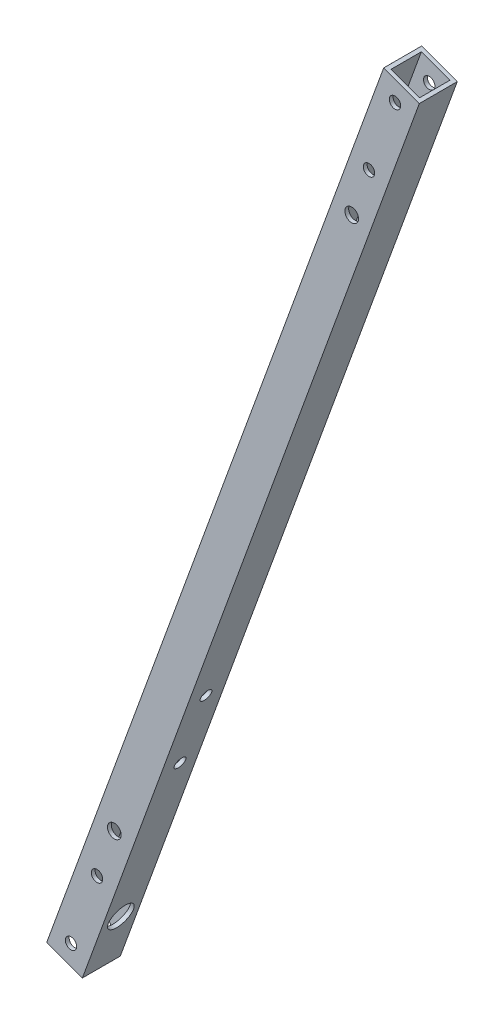
ISO-10303-21;
HEADER;
FILE_DESCRIPTION(('STEP AP214'),'2;1');
FILE_NAME('part.step','',(''),(''),'','','');
FILE_SCHEMA(('AUTOMOTIVE_DESIGN { 1 0 10303 214 1 1 1 1 }'));
ENDSEC;
DATA;
#1=APPLICATION_CONTEXT('core data for automotive mechanical design processes');
#2=APPLICATION_PROTOCOL_DEFINITION('international standard','automotive_design',2000,#1);
#3=PRODUCT_CONTEXT('',#1,'mechanical');
#4=PRODUCT('Part','Part','',(#3));
#5=PRODUCT_RELATED_PRODUCT_CATEGORY('part','',(#4));
#6=PRODUCT_DEFINITION_FORMATION('','',#4);
#7=PRODUCT_DEFINITION_CONTEXT('part definition',#1,'design');
#8=PRODUCT_DEFINITION('design','',#6,#7);
#9=PRODUCT_DEFINITION_SHAPE('','',#8);
#10=(LENGTH_UNIT() NAMED_UNIT(*) SI_UNIT(.MILLI.,.METRE.));
#11=(NAMED_UNIT(*) PLANE_ANGLE_UNIT() SI_UNIT($,.RADIAN.));
#12=(NAMED_UNIT(*) SI_UNIT($,.STERADIAN.) SOLID_ANGLE_UNIT());
#13=UNCERTAINTY_MEASURE_WITH_UNIT(LENGTH_MEASURE(1.E-05),#10,'distance_accuracy_value','');
#14=(GEOMETRIC_REPRESENTATION_CONTEXT(3) GLOBAL_UNCERTAINTY_ASSIGNED_CONTEXT((#13)) GLOBAL_UNIT_ASSIGNED_CONTEXT((#10,
#11,#12)) REPRESENTATION_CONTEXT('',''));
#15=CARTESIAN_POINT('',(0.,0.,0.));
#16=DIRECTION('',(0.,0.,1.));
#17=DIRECTION('',(1.,0.,0.));
#18=AXIS2_PLACEMENT_3D('',#15,#16,#17);
#19=CARTESIAN_POINT('',(-14.0953893117886,5.13030214988498,-15.));
#20=DIRECTION('',(0.342020143325665,0.93969262078591,0.));
#21=DIRECTION('',(-0.93969262078591,0.342020143325665,0.));
#22=AXIS2_PLACEMENT_3D('',#19,#20,#21);
#23=PLANE('',#22);
#24=DIRECTION('',(0.93969262078591,-0.342020143325665,0.));
#25=VECTOR('',#24,1.);
#26=CARTESIAN_POINT('',(-14.0953893117886,5.13030214988498,0.));
#27=LINE('',#26,#25);
#28=CARTESIAN_POINT('',(-14.0953893117886,5.13030214988498,0.));
#29=VERTEX_POINT('',#28);
#30=CARTESIAN_POINT('',(0.,0.,0.));
#31=VERTEX_POINT('',#30);
#32=EDGE_CURVE('E148',#29,#31,#27,.T.);
#33=ORIENTED_EDGE('',*,*,#32,.F.);
#34=DIRECTION('',(0.,0.,1.));
#35=VECTOR('',#34,1.);
#36=CARTESIAN_POINT('',(-14.0953893117886,5.13030214988498,-15.));
#37=LINE('',#36,#35);
#38=CARTESIAN_POINT('',(-14.0953893117886,5.13030214988498,-15.));
#39=VERTEX_POINT('',#38);
#40=EDGE_CURVE('E172',#39,#29,#37,.T.);
#41=ORIENTED_EDGE('',*,*,#40,.F.);
#42=DIRECTION('',(0.93969262078591,-0.342020143325665,0.));
#43=VECTOR('',#42,1.);
#44=CARTESIAN_POINT('',(-14.0953893117886,5.13030214988498,-15.));
#45=LINE('',#44,#43);
#46=CARTESIAN_POINT('',(0.,0.,-15.));
#47=VERTEX_POINT('',#46);
#48=EDGE_CURVE('E157',#39,#47,#45,.T.);
#49=ORIENTED_EDGE('',*,*,#48,.T.);
#50=DIRECTION('',(0.,0.,1.));
#51=VECTOR('',#50,1.);
#52=CARTESIAN_POINT('',(0.,0.,-15.));
#53=LINE('',#52,#51);
#54=EDGE_CURVE('E11',#47,#31,#53,.T.);
#55=ORIENTED_EDGE('',*,*,#54,.T.);
#56=EDGE_LOOP('',(#33,#41,#49,#55));
#57=FACE_BOUND('',#56,.T.);
#58=DIRECTION('',(0.93969262078591,-0.342020143325665,0.));
#59=VECTOR('',#58,1.);
#60=CARTESIAN_POINT('',(0.,0.,-1.5));
#61=LINE('',#60,#59);
#62=CARTESIAN_POINT('',(-12.6858503806098,4.61727193489649,-1.5));
#63=VERTEX_POINT('',#62);
#64=CARTESIAN_POINT('',(-1.40953893117884,0.513030214988488,-1.5));
#65=VERTEX_POINT('',#64);
#66=EDGE_CURVE('E121',#63,#65,#61,.T.);
#67=ORIENTED_EDGE('',*,*,#66,.T.);
#68=DIRECTION('',(0.,0.,1.));
#69=VECTOR('',#68,1.);
#70=CARTESIAN_POINT('',(-1.40953893117884,0.513030214988552,-15.));
#71=LINE('',#70,#69);
#72=CARTESIAN_POINT('',(-1.40953893117884,0.513030214988488,-13.5));
#73=VERTEX_POINT('',#72);
#74=EDGE_CURVE('E114',#73,#65,#71,.T.);
#75=ORIENTED_EDGE('',*,*,#74,.F.);
#76=DIRECTION('',(0.93969262078591,-0.342020143325665,0.));
#77=VECTOR('',#76,1.);
#78=CARTESIAN_POINT('',(0.,0.,-13.5));
#79=LINE('',#78,#77);
#80=CARTESIAN_POINT('',(-12.6858503806098,4.61727193489649,-13.5));
#81=VERTEX_POINT('',#80);
#82=EDGE_CURVE('E138',#81,#73,#79,.T.);
#83=ORIENTED_EDGE('',*,*,#82,.F.);
#84=DIRECTION('',(0.,0.,1.));
#85=VECTOR('',#84,1.);
#86=CARTESIAN_POINT('',(-12.6858503806098,4.61727193489649,-15.));
#87=LINE('',#86,#85);
#88=EDGE_CURVE('E143',#81,#63,#87,.T.);
#89=ORIENTED_EDGE('',*,*,#88,.T.);
#90=EDGE_LOOP('',(#67,#75,#83,#89));
#91=FACE_BOUND('',#90,.T.);
#92=ADVANCED_FACE('F43',(#57,#91),#23,.F.);
#93=CARTESIAN_POINT('',(133.115214400364,365.731045750865,-15.));
#94=DIRECTION('',(-0.342020143325665,-0.93969262078591,0.));
#95=DIRECTION('',(0.93969262078591,-0.342020143325665,0.));
#96=AXIS2_PLACEMENT_3D('',#93,#94,#95);
#97=PLANE('',#96);
#98=DIRECTION('',(-0.93969262078591,0.342020143325665,0.));
#99=VECTOR('',#98,1.);
#100=CARTESIAN_POINT('',(133.115214400364,365.731045750865,0.));
#101=LINE('',#100,#99);
#102=CARTESIAN_POINT('',(133.115214400364,365.731045750865,0.));
#103=VERTEX_POINT('',#102);
#104=CARTESIAN_POINT('',(119.019825088576,370.86134790075,0.));
#105=VERTEX_POINT('',#104);
#106=EDGE_CURVE('E179',#103,#105,#101,.T.);
#107=ORIENTED_EDGE('',*,*,#106,.F.);
#108=DIRECTION('',(0.,0.,1.));
#109=VECTOR('',#108,1.);
#110=CARTESIAN_POINT('',(133.115214400364,365.731045750865,-15.));
#111=LINE('',#110,#109);
#112=CARTESIAN_POINT('',(133.115214400364,365.731045750865,-15.));
#113=VERTEX_POINT('',#112);
#114=EDGE_CURVE('E52',#113,#103,#111,.T.);
#115=ORIENTED_EDGE('',*,*,#114,.F.);
#116=DIRECTION('',(-0.93969262078591,0.342020143325665,0.));
#117=VECTOR('',#116,1.);
#118=CARTESIAN_POINT('',(133.115214400364,365.731045750865,-15.));
#119=LINE('',#118,#117);
#120=CARTESIAN_POINT('',(119.019825088576,370.86134790075,-15.));
#121=VERTEX_POINT('',#120);
#122=EDGE_CURVE('E165',#113,#121,#119,.T.);
#123=ORIENTED_EDGE('',*,*,#122,.T.);
#124=DIRECTION('',(0.,0.,1.));
#125=VECTOR('',#124,1.);
#126=CARTESIAN_POINT('',(119.019825088576,370.86134790075,-15.));
#127=LINE('',#126,#125);
#128=EDGE_CURVE('E188',#121,#105,#127,.T.);
#129=ORIENTED_EDGE('',*,*,#128,.T.);
#130=EDGE_LOOP('',(#107,#115,#123,#129));
#131=FACE_BOUND('',#130,.T.);
#132=DIRECTION('',(-0.93969262078591,0.342020143325665,0.));
#133=VECTOR('',#132,1.);
#134=CARTESIAN_POINT('',(133.115214400364,365.731045750865,-1.5));
#135=LINE('',#134,#133);
#136=CARTESIAN_POINT('',(131.705675469185,366.244075965854,-1.5));
#137=VERTEX_POINT('',#136);
#138=CARTESIAN_POINT('',(120.429364019754,370.348317685762,-1.5));
#139=VERTEX_POINT('',#138);
#140=EDGE_CURVE('E120',#137,#139,#135,.T.);
#141=ORIENTED_EDGE('',*,*,#140,.T.);
#142=DIRECTION('',(0.,0.,1.));
#143=VECTOR('',#142,1.);
#144=CARTESIAN_POINT('',(120.429364019754,370.348317685762,-15.));
#145=LINE('',#144,#143);
#146=CARTESIAN_POINT('',(120.429364019754,370.348317685762,-13.5));
#147=VERTEX_POINT('',#146);
#148=EDGE_CURVE('E129',#147,#139,#145,.T.);
#149=ORIENTED_EDGE('',*,*,#148,.F.);
#150=DIRECTION('',(-0.93969262078591,0.342020143325665,0.));
#151=VECTOR('',#150,1.);
#152=CARTESIAN_POINT('',(133.115214400364,365.731045750865,-13.5));
#153=LINE('',#152,#151);
#154=CARTESIAN_POINT('',(131.705675469185,366.244075965854,-13.5));
#155=VERTEX_POINT('',#154);
#156=EDGE_CURVE('E127',#155,#147,#153,.T.);
#157=ORIENTED_EDGE('',*,*,#156,.F.);
#158=DIRECTION('',(0.,0.,1.));
#159=VECTOR('',#158,1.);
#160=CARTESIAN_POINT('',(131.705675469185,366.244075965854,-15.));
#161=LINE('',#160,#159);
#162=EDGE_CURVE('E111',#155,#137,#161,.T.);
#163=ORIENTED_EDGE('',*,*,#162,.T.);
#164=EDGE_LOOP('',(#141,#149,#157,#163));
#165=FACE_BOUND('',#164,.T.);
#166=ADVANCED_FACE('F125',(#131,#165),#97,.F.);
#167=CARTESIAN_POINT('',(133.115214400364,365.731045750865,-15.));
#168=DIRECTION('',(-0.93969262078591,0.342020143325665,0.));
#169=DIRECTION('',(-0.342020143325665,-0.93969262078591,0.));
#170=AXIS2_PLACEMENT_3D('',#167,#168,#169);
#171=PLANE('',#170);
#172=CARTESIAN_POINT('',(7.69545322482748,21.143083967683,-7.5));
#173=DIRECTION('',(-0.93969262078591,0.342020143325666,0.));
#174=DIRECTION('',(0.342020143325666,0.93969262078591,0.));
#175=AXIS2_PLACEMENT_3D('',#172,#173,#174);
#176=CIRCLE('',#175,4.99999999999999);
#177=CARTESIAN_POINT('',(9.4055539414558,25.8415470716125,-7.5));
#178=VERTEX_POINT('',#177);
#179=EDGE_CURVE('E332',#178,#178,#176,.T.);
#180=ORIENTED_EDGE('',*,*,#179,.T.);
#181=EDGE_LOOP('',(#180));
#182=FACE_BOUND('',#181,.T.);
#183=CARTESIAN_POINT('',(41.3426140285346,113.587898504628,-7.5));
#184=DIRECTION('',(0.93969262078591,-0.342020143325665,0.));
#185=DIRECTION('',(-0.342020143325665,-0.93969262078591,0.));
#186=AXIS2_PLACEMENT_3D('',#183,#184,#185);
#187=CIRCLE('',#186,2.25);
#188=CARTESIAN_POINT('',(40.5730687060519,111.47359010786,-7.5));
#189=VERTEX_POINT('',#188);
#190=EDGE_CURVE('E258',#189,#189,#187,.T.);
#191=ORIENTED_EDGE('',*,*,#190,.F.);
#192=EDGE_LOOP('',(#191));
#193=FACE_BOUND('',#192,.T.);
#194=CARTESIAN_POINT('',(31.0820097287646,85.3971198810506,-7.5));
#195=DIRECTION('',(0.93969262078591,-0.342020143325665,0.));
#196=DIRECTION('',(-0.342020143325665,-0.93969262078591,0.));
#197=AXIS2_PLACEMENT_3D('',#194,#195,#196);
#198=CIRCLE('',#197,2.25);
#199=CARTESIAN_POINT('',(30.3124644062819,83.2828114842823,-7.5));
#200=VERTEX_POINT('',#199);
#201=EDGE_CURVE('E242',#200,#200,#198,.T.);
#202=ORIENTED_EDGE('',*,*,#201,.F.);
#203=EDGE_LOOP('',(#202));
#204=FACE_BOUND('',#203,.T.);
#205=DIRECTION('',(0.342020143325665,0.93969262078591,0.));
#206=VECTOR('',#205,1.);
#207=CARTESIAN_POINT('',(133.115214400364,365.731045750865,0.));
#208=LINE('',#207,#206);
#209=EDGE_CURVE('E176',#31,#103,#208,.T.);
#210=ORIENTED_EDGE('',*,*,#209,.F.);
#211=ORIENTED_EDGE('',*,*,#54,.F.);
#212=DIRECTION('',(0.342020143325665,0.93969262078591,0.));
#213=VECTOR('',#212,1.);
#214=CARTESIAN_POINT('',(133.115214400364,365.731045750865,-15.));
#215=LINE('',#214,#213);
#216=EDGE_CURVE('E161',#47,#113,#215,.T.);
#217=ORIENTED_EDGE('',*,*,#216,.T.);
#218=ORIENTED_EDGE('',*,*,#114,.T.);
#219=EDGE_LOOP('',(#210,#211,#217,#218));
#220=FACE_BOUND('',#219,.T.);
#221=ADVANCED_FACE('F373',(#182,#193,#204,#220),#171,.F.);
#222=CARTESIAN_POINT('',(119.019825088576,370.86134790075,-15.));
#223=DIRECTION('',(0.93969262078591,-0.342020143325666,0.));
#224=DIRECTION('',(0.342020143325666,0.93969262078591,0.));
#225=AXIS2_PLACEMENT_3D('',#222,#223,#224);
#226=PLANE('',#225);
#227=CARTESIAN_POINT('',(27.2472247167459,118.718200654513,-7.5));
#228=DIRECTION('',(0.93969262078591,-0.342020143325665,0.));
#229=DIRECTION('',(-0.342020143325665,-0.93969262078591,0.));
#230=AXIS2_PLACEMENT_3D('',#227,#228,#229);
#231=CIRCLE('',#230,2.25);
#232=CARTESIAN_POINT('',(26.4776793942632,116.603892257745,-7.5));
#233=VERTEX_POINT('',#232);
#234=EDGE_CURVE('E233',#233,#233,#231,.T.);
#235=ORIENTED_EDGE('',*,*,#234,.T.);
#236=EDGE_LOOP('',(#235));
#237=FACE_BOUND('',#236,.T.);
#238=CARTESIAN_POINT('',(16.986620416976,90.5274220309356,-7.5));
#239=DIRECTION('',(0.93969262078591,-0.342020143325665,0.));
#240=DIRECTION('',(-0.342020143325665,-0.93969262078591,0.));
#241=AXIS2_PLACEMENT_3D('',#238,#239,#240);
#242=CIRCLE('',#241,2.25);
#243=CARTESIAN_POINT('',(16.2170750944932,88.4131136341673,-7.5));
#244=VERTEX_POINT('',#243);
#245=EDGE_CURVE('E346',#244,#244,#242,.T.);
#246=ORIENTED_EDGE('',*,*,#245,.T.);
#247=EDGE_LOOP('',(#246));
#248=FACE_BOUND('',#247,.T.);
#249=CARTESIAN_POINT('',(-6.39993608696117,26.273386117568,-7.5));
#250=DIRECTION('',(0.93969262078591,-0.342020143325665,0.));
#251=DIRECTION('',(-0.342020143325665,-0.93969262078591,0.));
#252=AXIS2_PLACEMENT_3D('',#249,#250,#251);
#253=CIRCLE('',#252,2.7);
#254=CARTESIAN_POINT('',(-7.32339047394047,23.736216041446,-7.5));
#255=VERTEX_POINT('',#254);
#256=EDGE_CURVE('E251',#255,#255,#253,.T.);
#257=ORIENTED_EDGE('',*,*,#256,.T.);
#258=EDGE_LOOP('',(#257));
#259=FACE_BOUND('',#258,.T.);
#260=DIRECTION('',(-0.342020143325666,-0.93969262078591,0.));
#261=VECTOR('',#260,1.);
#262=CARTESIAN_POINT('',(119.019825088576,370.86134790075,0.));
#263=LINE('',#262,#261);
#264=EDGE_CURVE('E162',#105,#29,#263,.T.);
#265=ORIENTED_EDGE('',*,*,#264,.F.);
#266=ORIENTED_EDGE('',*,*,#128,.F.);
#267=DIRECTION('',(-0.342020143325666,-0.93969262078591,0.));
#268=VECTOR('',#267,1.);
#269=CARTESIAN_POINT('',(119.019825088576,370.86134790075,-15.));
#270=LINE('',#269,#268);
#271=EDGE_CURVE('E169',#121,#39,#270,.T.);
#272=ORIENTED_EDGE('',*,*,#271,.T.);
#273=ORIENTED_EDGE('',*,*,#40,.T.);
#274=EDGE_LOOP('',(#265,#266,#272,#273));
#275=FACE_BOUND('',#274,.T.);
#276=ADVANCED_FACE('F369',(#237,#248,#259,#275),#226,.F.);
#277=CARTESIAN_POINT('',(0.,0.,-15.));
#278=DIRECTION('',(0.,0.,1.));
#279=DIRECTION('',(-1.,0.,0.));
#280=AXIS2_PLACEMENT_3D('',#277,#278,#279);
#281=PLANE('',#280);
#282=CARTESIAN_POINT('',(106.401361503244,314.263871130618,-15.));
#283=DIRECTION('',(0.,0.,1.));
#284=DIRECTION('',(1.,0.,0.));
#285=AXIS2_PLACEMENT_3D('',#282,#283,#284);
#286=CIRCLE('',#285,4.99999999999999);
#287=CARTESIAN_POINT('',(111.401361503244,314.263871130618,-15.));
#288=VERTEX_POINT('',#287);
#289=EDGE_CURVE('E313',#288,#288,#286,.T.);
#290=ORIENTED_EDGE('',*,*,#289,.T.);
#291=EDGE_LOOP('',(#290));
#292=FACE_BOUND('',#291,.T.);
#293=CARTESIAN_POINT('',(12.6184635853316,56.5974767701322,-15.));
#294=DIRECTION('',(0.,0.,1.));
#295=DIRECTION('',(1.,0.,0.));
#296=AXIS2_PLACEMENT_3D('',#293,#294,#295);
#297=CIRCLE('',#296,4.99999999999999);
#298=CARTESIAN_POINT('',(17.6184635853316,56.5974767701322,-15.));
#299=VERTEX_POINT('',#298);
#300=EDGE_CURVE('E322',#299,#299,#297,.T.);
#301=ORIENTED_EDGE('',*,*,#300,.T.);
#302=EDGE_LOOP('',(#301));
#303=FACE_BOUND('',#302,.T.);
#304=CARTESIAN_POINT('',(-4.48254358095182,9.61284573083681,-15.));
#305=DIRECTION('',(0.,0.,1.));
#306=DIRECTION('',(1.,0.,0.));
#307=AXIS2_PLACEMENT_3D('',#304,#305,#306);
#308=CIRCLE('',#307,2.25);
#309=CARTESIAN_POINT('',(-2.23254358095182,9.61284573083681,-15.));
#310=VERTEX_POINT('',#309);
#311=EDGE_CURVE('E200',#310,#310,#308,.T.);
#312=ORIENTED_EDGE('',*,*,#311,.T.);
#313=EDGE_LOOP('',(#312));
#314=FACE_BOUND('',#313,.T.);
#315=CARTESIAN_POINT('',(123.502368669527,361.248502169914,-15.));
#316=DIRECTION('',(0.,0.,1.));
#317=DIRECTION('',(1.,0.,0.));
#318=AXIS2_PLACEMENT_3D('',#315,#316,#317);
#319=CIRCLE('',#318,2.25);
#320=CARTESIAN_POINT('',(125.752368669527,361.248502169914,-15.));
#321=VERTEX_POINT('',#320);
#322=EDGE_CURVE('E266',#321,#321,#319,.T.);
#323=ORIENTED_EDGE('',*,*,#322,.T.);
#324=EDGE_LOOP('',(#323));
#325=FACE_BOUND('',#324,.T.);
#326=CARTESIAN_POINT('',(113.241764369757,333.057723546336,-15.));
#327=DIRECTION('',(0.,0.,1.));
#328=DIRECTION('',(1.,0.,0.));
#329=AXIS2_PLACEMENT_3D('',#326,#327,#328);
#330=CIRCLE('',#329,2.25);
#331=CARTESIAN_POINT('',(115.491764369758,333.057723546336,-15.));
#332=VERTEX_POINT('',#331);
#333=EDGE_CURVE('E270',#332,#332,#330,.T.);
#334=ORIENTED_EDGE('',*,*,#333,.T.);
#335=EDGE_LOOP('',(#334));
#336=FACE_BOUND('',#335,.T.);
#337=CARTESIAN_POINT('',(5.77806071881815,37.8036243544141,-15.));
#338=DIRECTION('',(0.,0.,1.));
#339=DIRECTION('',(1.,0.,0.));
#340=AXIS2_PLACEMENT_3D('',#337,#338,#339);
#341=CIRCLE('',#340,2.25);
#342=CARTESIAN_POINT('',(8.02806071881815,37.8036243544141,-15.));
#343=VERTEX_POINT('',#342);
#344=EDGE_CURVE('E262',#343,#343,#341,.T.);
#345=ORIENTED_EDGE('',*,*,#344,.T.);
#346=EDGE_LOOP('',(#345));
#347=FACE_BOUND('',#346,.T.);
#348=ORIENTED_EDGE('',*,*,#48,.F.);
#349=ORIENTED_EDGE('',*,*,#271,.F.);
#350=ORIENTED_EDGE('',*,*,#122,.F.);
#351=ORIENTED_EDGE('',*,*,#216,.F.);
#352=EDGE_LOOP('',(#348,#349,#350,#351));
#353=FACE_BOUND('',#352,.T.);
#354=ADVANCED_FACE('F372',(#292,#303,#314,#325,#336,#347,#353),#281,.F.);
#355=CARTESIAN_POINT('',(0.,0.,0.));
#356=DIRECTION('',(0.,0.,1.));
#357=DIRECTION('',(-1.,0.,0.));
#358=AXIS2_PLACEMENT_3D('',#355,#356,#357);
#359=PLANE('',#358);
#360=CARTESIAN_POINT('',(-4.48254358095182,9.61284573083681,0.));
#361=DIRECTION('',(0.,0.,-1.));
#362=DIRECTION('',(-1.,0.,0.));
#363=AXIS2_PLACEMENT_3D('',#360,#361,#362);
#364=CIRCLE('',#363,2.25);
#365=CARTESIAN_POINT('',(-6.73254358095182,9.61284573083681,0.));
#366=VERTEX_POINT('',#365);
#367=EDGE_CURVE('E156',#366,#366,#364,.T.);
#368=ORIENTED_EDGE('',*,*,#367,.T.);
#369=EDGE_LOOP('',(#368));
#370=FACE_BOUND('',#369,.T.);
#371=CARTESIAN_POINT('',(123.502368669527,361.248502169914,0.));
#372=DIRECTION('',(0.,0.,-1.));
#373=DIRECTION('',(-1.,0.,0.));
#374=AXIS2_PLACEMENT_3D('',#371,#372,#373);
#375=CIRCLE('',#374,2.25);
#376=CARTESIAN_POINT('',(121.252368669527,361.248502169914,0.));
#377=VERTEX_POINT('',#376);
#378=EDGE_CURVE('E228',#377,#377,#375,.T.);
#379=ORIENTED_EDGE('',*,*,#378,.T.);
#380=EDGE_LOOP('',(#379));
#381=FACE_BOUND('',#380,.T.);
#382=CARTESIAN_POINT('',(113.241764369757,333.057723546336,0.));
#383=DIRECTION('',(0.,0.,-1.));
#384=DIRECTION('',(-1.,0.,0.));
#385=AXIS2_PLACEMENT_3D('',#382,#383,#384);
#386=CIRCLE('',#385,2.25);
#387=CARTESIAN_POINT('',(110.991764369757,333.057723546336,0.));
#388=VERTEX_POINT('',#387);
#389=EDGE_CURVE('E222',#388,#388,#386,.T.);
#390=ORIENTED_EDGE('',*,*,#389,.T.);
#391=EDGE_LOOP('',(#390));
#392=FACE_BOUND('',#391,.T.);
#393=CARTESIAN_POINT('',(12.6184635853316,56.5974767701322,0.));
#394=DIRECTION('',(0.,0.,-1.));
#395=DIRECTION('',(-1.,0.,0.));
#396=AXIS2_PLACEMENT_3D('',#393,#394,#395);
#397=CIRCLE('',#396,2.7);
#398=CARTESIAN_POINT('',(9.91846358533157,56.5974767701322,0.));
#399=VERTEX_POINT('',#398);
#400=EDGE_CURVE('E211',#399,#399,#397,.T.);
#401=ORIENTED_EDGE('',*,*,#400,.T.);
#402=EDGE_LOOP('',(#401));
#403=FACE_BOUND('',#402,.T.);
#404=CARTESIAN_POINT('',(106.401361503244,314.263871130618,0.));
#405=DIRECTION('',(0.,0.,-1.));
#406=DIRECTION('',(-1.,0.,0.));
#407=AXIS2_PLACEMENT_3D('',#404,#405,#406);
#408=CIRCLE('',#407,2.69999999999999);
#409=CARTESIAN_POINT('',(103.701361503244,314.263871130618,0.));
#410=VERTEX_POINT('',#409);
#411=EDGE_CURVE('E205',#410,#410,#408,.T.);
#412=ORIENTED_EDGE('',*,*,#411,.T.);
#413=EDGE_LOOP('',(#412));
#414=FACE_BOUND('',#413,.T.);
#415=CARTESIAN_POINT('',(5.77806071881815,37.8036243544141,0.));
#416=DIRECTION('',(0.,0.,-1.));
#417=DIRECTION('',(-1.,0.,0.));
#418=AXIS2_PLACEMENT_3D('',#415,#416,#417);
#419=CIRCLE('',#418,2.25);
#420=CARTESIAN_POINT('',(3.52806071881815,37.8036243544141,0.));
#421=VERTEX_POINT('',#420);
#422=EDGE_CURVE('E206',#421,#421,#419,.T.);
#423=ORIENTED_EDGE('',*,*,#422,.T.);
#424=EDGE_LOOP('',(#423));
#425=FACE_BOUND('',#424,.T.);
#426=ORIENTED_EDGE('',*,*,#32,.T.);
#427=ORIENTED_EDGE('',*,*,#209,.T.);
#428=ORIENTED_EDGE('',*,*,#106,.T.);
#429=ORIENTED_EDGE('',*,*,#264,.T.);
#430=EDGE_LOOP('',(#426,#427,#428,#429));
#431=FACE_BOUND('',#430,.T.);
#432=ADVANCED_FACE('F387',(#370,#381,#392,#403,#414,#425,#431),#359,.T.);
#433=CARTESIAN_POINT('',(131.705675469185,366.244075965854,-15.));
#434=DIRECTION('',(-0.93969262078591,0.342020143325665,0.));
#435=DIRECTION('',(-0.342020143325665,-0.93969262078591,0.));
#436=AXIS2_PLACEMENT_3D('',#433,#434,#435);
#437=PLANE('',#436);
#438=CARTESIAN_POINT('',(6.28591429364861,21.6561141826715,-7.5));
#439=DIRECTION('',(-0.93969262078591,0.342020143325666,0.));
#440=DIRECTION('',(0.342020143325666,0.93969262078591,0.));
#441=AXIS2_PLACEMENT_3D('',#438,#439,#440);
#442=CIRCLE('',#441,5.);
#443=CARTESIAN_POINT('',(7.99601501027693,26.354577286601,-7.5));
#444=VERTEX_POINT('',#443);
#445=EDGE_CURVE('E337',#444,#444,#442,.T.);
#446=ORIENTED_EDGE('',*,*,#445,.F.);
#447=EDGE_LOOP('',(#446));
#448=FACE_BOUND('',#447,.T.);
#449=CARTESIAN_POINT('',(39.9330750973557,114.100928719616,-7.5));
#450=DIRECTION('',(0.93969262078591,-0.342020143325665,0.));
#451=DIRECTION('',(-0.342020143325665,-0.93969262078591,0.));
#452=AXIS2_PLACEMENT_3D('',#449,#450,#451);
#453=CIRCLE('',#452,2.25);
#454=CARTESIAN_POINT('',(39.163529774873,111.986620322848,-7.5));
#455=VERTEX_POINT('',#454);
#456=EDGE_CURVE('E254',#455,#455,#453,.T.);
#457=ORIENTED_EDGE('',*,*,#456,.T.);
#458=EDGE_LOOP('',(#457));
#459=FACE_BOUND('',#458,.T.);
#460=CARTESIAN_POINT('',(29.6724707975858,85.9101500960391,-7.5));
#461=DIRECTION('',(0.93969262078591,-0.342020143325665,0.));
#462=DIRECTION('',(-0.342020143325665,-0.93969262078591,0.));
#463=AXIS2_PLACEMENT_3D('',#460,#461,#462);
#464=CIRCLE('',#463,2.25);
#465=CARTESIAN_POINT('',(28.902925475103,83.7958416992708,-7.5));
#466=VERTEX_POINT('',#465);
#467=EDGE_CURVE('E236',#466,#466,#464,.T.);
#468=ORIENTED_EDGE('',*,*,#467,.T.);
#469=EDGE_LOOP('',(#468));
#470=FACE_BOUND('',#469,.T.);
#471=DIRECTION('',(0.342020143325665,0.93969262078591,0.));
#472=VECTOR('',#471,1.);
#473=CARTESIAN_POINT('',(-1.40953893117887,0.513030214988499,-1.5));
#474=LINE('',#473,#472);
#475=EDGE_CURVE('E108',#65,#137,#474,.T.);
#476=ORIENTED_EDGE('',*,*,#475,.T.);
#477=ORIENTED_EDGE('',*,*,#162,.F.);
#478=DIRECTION('',(0.342020143325665,0.93969262078591,0.));
#479=VECTOR('',#478,1.);
#480=CARTESIAN_POINT('',(-1.40953893117887,0.513030214988499,-13.5));
#481=LINE('',#480,#479);
#482=EDGE_CURVE('E65',#73,#155,#481,.T.);
#483=ORIENTED_EDGE('',*,*,#482,.F.);
#484=ORIENTED_EDGE('',*,*,#74,.T.);
#485=EDGE_LOOP('',(#476,#477,#483,#484));
#486=FACE_BOUND('',#485,.T.);
#487=ADVANCED_FACE('F110',(#448,#459,#470,#486),#437,.T.);
#488=CARTESIAN_POINT('',(120.429364019754,370.348317685762,-15.));
#489=DIRECTION('',(0.93969262078591,-0.342020143325666,0.));
#490=DIRECTION('',(0.342020143325666,0.93969262078591,0.));
#491=AXIS2_PLACEMENT_3D('',#488,#489,#490);
#492=PLANE('',#491);
#493=CARTESIAN_POINT('',(28.6567636479248,118.205170439524,-7.5));
#494=DIRECTION('',(-0.93969262078591,0.342020143325666,0.));
#495=DIRECTION('',(0.342020143325666,0.93969262078591,0.));
#496=AXIS2_PLACEMENT_3D('',#493,#494,#495);
#497=CIRCLE('',#496,2.25);
#498=CARTESIAN_POINT('',(29.4263089704076,120.319478836293,-7.5));
#499=VERTEX_POINT('',#498);
#500=EDGE_CURVE('E46',#499,#499,#497,.T.);
#501=ORIENTED_EDGE('',*,*,#500,.T.);
#502=EDGE_LOOP('',(#501));
#503=FACE_BOUND('',#502,.T.);
#504=CARTESIAN_POINT('',(18.3961593481548,90.0143918159471,-7.5));
#505=DIRECTION('',(-0.93969262078591,0.342020143325666,0.));
#506=DIRECTION('',(0.342020143325666,0.93969262078591,0.));
#507=AXIS2_PLACEMENT_3D('',#504,#505,#506);
#508=CIRCLE('',#507,2.25);
#509=CARTESIAN_POINT('',(19.1657046706376,92.1287002127154,-7.5));
#510=VERTEX_POINT('',#509);
#511=EDGE_CURVE('E232',#510,#510,#508,.T.);
#512=ORIENTED_EDGE('',*,*,#511,.T.);
#513=EDGE_LOOP('',(#512));
#514=FACE_BOUND('',#513,.T.);
#515=CARTESIAN_POINT('',(-4.99039715578231,25.7603559025795,-7.5));
#516=DIRECTION('',(-0.93969262078591,0.342020143325666,0.));
#517=DIRECTION('',(0.342020143325666,0.93969262078591,0.));
#518=AXIS2_PLACEMENT_3D('',#515,#516,#517);
#519=CIRCLE('',#518,2.7);
#520=CARTESIAN_POINT('',(-4.06694276880301,28.2975259787014,-7.5));
#521=VERTEX_POINT('',#520);
#522=EDGE_CURVE('E229',#521,#521,#519,.T.);
#523=ORIENTED_EDGE('',*,*,#522,.T.);
#524=EDGE_LOOP('',(#523));
#525=FACE_BOUND('',#524,.T.);
#526=DIRECTION('',(-0.342020143325666,-0.93969262078591,0.));
#527=VECTOR('',#526,1.);
#528=CARTESIAN_POINT('',(-12.6858503806098,4.61727193489648,-1.5));
#529=LINE('',#528,#527);
#530=EDGE_CURVE('E132',#139,#63,#529,.T.);
#531=ORIENTED_EDGE('',*,*,#530,.T.);
#532=ORIENTED_EDGE('',*,*,#88,.F.);
#533=DIRECTION('',(-0.342020143325666,-0.93969262078591,0.));
#534=VECTOR('',#533,1.);
#535=CARTESIAN_POINT('',(-12.6858503806098,4.61727193489648,-13.5));
#536=LINE('',#535,#534);
#537=EDGE_CURVE('E60',#147,#81,#536,.T.);
#538=ORIENTED_EDGE('',*,*,#537,.F.);
#539=ORIENTED_EDGE('',*,*,#148,.T.);
#540=EDGE_LOOP('',(#531,#532,#538,#539));
#541=FACE_BOUND('',#540,.T.);
#542=ADVANCED_FACE('F358',(#503,#514,#525,#541),#492,.T.);
#543=CARTESIAN_POINT('',(0.,0.,-13.5));
#544=DIRECTION('',(0.,0.,1.));
#545=DIRECTION('',(-1.,0.,0.));
#546=AXIS2_PLACEMENT_3D('',#543,#544,#545);
#547=PLANE('',#546);
#548=CARTESIAN_POINT('',(106.401361503244,314.263871130618,-13.5));
#549=DIRECTION('',(0.,0.,1.));
#550=DIRECTION('',(1.,0.,0.));
#551=AXIS2_PLACEMENT_3D('',#548,#549,#550);
#552=CIRCLE('',#551,4.99999999999999);
#553=CARTESIAN_POINT('',(111.401361503244,314.263871130618,-13.5));
#554=VERTEX_POINT('',#553);
#555=EDGE_CURVE('E317',#554,#554,#552,.T.);
#556=ORIENTED_EDGE('',*,*,#555,.F.);
#557=EDGE_LOOP('',(#556));
#558=FACE_BOUND('',#557,.T.);
#559=CARTESIAN_POINT('',(12.6184635853316,56.5974767701322,-13.5));
#560=DIRECTION('',(0.,0.,1.));
#561=DIRECTION('',(1.,0.,0.));
#562=AXIS2_PLACEMENT_3D('',#559,#560,#561);
#563=CIRCLE('',#562,4.99999999999999);
#564=CARTESIAN_POINT('',(17.6184635853316,56.5974767701322,-13.5));
#565=VERTEX_POINT('',#564);
#566=EDGE_CURVE('E327',#565,#565,#563,.T.);
#567=ORIENTED_EDGE('',*,*,#566,.F.);
#568=EDGE_LOOP('',(#567));
#569=FACE_BOUND('',#568,.T.);
#570=CARTESIAN_POINT('',(-4.48254358095182,9.61284573083681,-13.5));
#571=DIRECTION('',(0.,0.,-1.));
#572=DIRECTION('',(-1.,0.,0.));
#573=AXIS2_PLACEMENT_3D('',#570,#571,#572);
#574=CIRCLE('',#573,2.25);
#575=CARTESIAN_POINT('',(-6.73254358095182,9.61284573083681,-13.5));
#576=VERTEX_POINT('',#575);
#577=EDGE_CURVE('E227',#576,#576,#574,.T.);
#578=ORIENTED_EDGE('',*,*,#577,.T.);
#579=EDGE_LOOP('',(#578));
#580=FACE_BOUND('',#579,.T.);
#581=CARTESIAN_POINT('',(123.502368669527,361.248502169914,-13.5));
#582=DIRECTION('',(0.,0.,-1.));
#583=DIRECTION('',(-1.,0.,0.));
#584=AXIS2_PLACEMENT_3D('',#581,#582,#583);
#585=CIRCLE('',#584,2.25);
#586=CARTESIAN_POINT('',(121.252368669527,361.248502169914,-13.5));
#587=VERTEX_POINT('',#586);
#588=EDGE_CURVE('E221',#587,#587,#585,.T.);
#589=ORIENTED_EDGE('',*,*,#588,.T.);
#590=EDGE_LOOP('',(#589));
#591=FACE_BOUND('',#590,.T.);
#592=CARTESIAN_POINT('',(113.241764369757,333.057723546336,-13.5));
#593=DIRECTION('',(0.,0.,-1.));
#594=DIRECTION('',(-1.,0.,0.));
#595=AXIS2_PLACEMENT_3D('',#592,#593,#594);
#596=CIRCLE('',#595,2.25);
#597=CARTESIAN_POINT('',(110.991764369757,333.057723546336,-13.5));
#598=VERTEX_POINT('',#597);
#599=EDGE_CURVE('E216',#598,#598,#596,.T.);
#600=ORIENTED_EDGE('',*,*,#599,.T.);
#601=EDGE_LOOP('',(#600));
#602=FACE_BOUND('',#601,.T.);
#603=CARTESIAN_POINT('',(5.77806071881815,37.8036243544141,-13.5));
#604=DIRECTION('',(0.,0.,-1.));
#605=DIRECTION('',(-1.,0.,0.));
#606=AXIS2_PLACEMENT_3D('',#603,#604,#605);
#607=CIRCLE('',#606,2.25);
#608=CARTESIAN_POINT('',(3.52806071881815,37.8036243544141,-13.5));
#609=VERTEX_POINT('',#608);
#610=EDGE_CURVE('E199',#609,#609,#607,.T.);
#611=ORIENTED_EDGE('',*,*,#610,.T.);
#612=EDGE_LOOP('',(#611));
#613=FACE_BOUND('',#612,.T.);
#614=ORIENTED_EDGE('',*,*,#82,.T.);
#615=ORIENTED_EDGE('',*,*,#482,.T.);
#616=ORIENTED_EDGE('',*,*,#156,.T.);
#617=ORIENTED_EDGE('',*,*,#537,.T.);
#618=EDGE_LOOP('',(#614,#615,#616,#617));
#619=FACE_BOUND('',#618,.T.);
#620=ADVANCED_FACE('F397',(#558,#569,#580,#591,#602,#613,#619),#547,.T.);
#621=CARTESIAN_POINT('',(0.,0.,-1.5));
#622=DIRECTION('',(0.,0.,1.));
#623=DIRECTION('',(-1.,0.,0.));
#624=AXIS2_PLACEMENT_3D('',#621,#622,#623);
#625=PLANE('',#624);
#626=CARTESIAN_POINT('',(-4.48254358095182,9.61284573083681,-1.5));
#627=DIRECTION('',(0.,0.,-1.));
#628=DIRECTION('',(-1.,0.,0.));
#629=AXIS2_PLACEMENT_3D('',#626,#627,#628);
#630=CIRCLE('',#629,2.25);
#631=CARTESIAN_POINT('',(-6.73254358095182,9.61284573083681,-1.5));
#632=VERTEX_POINT('',#631);
#633=EDGE_CURVE('E223',#632,#632,#630,.T.);
#634=ORIENTED_EDGE('',*,*,#633,.F.);
#635=EDGE_LOOP('',(#634));
#636=FACE_BOUND('',#635,.T.);
#637=CARTESIAN_POINT('',(123.502368669527,361.248502169914,-1.5));
#638=DIRECTION('',(0.,0.,-1.));
#639=DIRECTION('',(-1.,0.,0.));
#640=AXIS2_PLACEMENT_3D('',#637,#638,#639);
#641=CIRCLE('',#640,2.25);
#642=CARTESIAN_POINT('',(121.252368669527,361.248502169914,-1.5));
#643=VERTEX_POINT('',#642);
#644=EDGE_CURVE('E217',#643,#643,#641,.T.);
#645=ORIENTED_EDGE('',*,*,#644,.F.);
#646=EDGE_LOOP('',(#645));
#647=FACE_BOUND('',#646,.T.);
#648=CARTESIAN_POINT('',(113.241764369757,333.057723546336,-1.5));
#649=DIRECTION('',(0.,0.,-1.));
#650=DIRECTION('',(-1.,0.,0.));
#651=AXIS2_PLACEMENT_3D('',#648,#649,#650);
#652=CIRCLE('',#651,2.25);
#653=CARTESIAN_POINT('',(110.991764369757,333.057723546336,-1.5));
#654=VERTEX_POINT('',#653);
#655=EDGE_CURVE('E212',#654,#654,#652,.T.);
#656=ORIENTED_EDGE('',*,*,#655,.F.);
#657=EDGE_LOOP('',(#656));
#658=FACE_BOUND('',#657,.T.);
#659=CARTESIAN_POINT('',(12.6184635853316,56.5974767701322,-1.5));
#660=DIRECTION('',(0.,0.,-1.));
#661=DIRECTION('',(-1.,0.,0.));
#662=AXIS2_PLACEMENT_3D('',#659,#660,#661);
#663=CIRCLE('',#662,2.7);
#664=CARTESIAN_POINT('',(9.91846358533157,56.5974767701322,-1.5));
#665=VERTEX_POINT('',#664);
#666=EDGE_CURVE('E207',#665,#665,#663,.T.);
#667=ORIENTED_EDGE('',*,*,#666,.F.);
#668=EDGE_LOOP('',(#667));
#669=FACE_BOUND('',#668,.T.);
#670=CARTESIAN_POINT('',(106.401361503244,314.263871130618,-1.5));
#671=DIRECTION('',(0.,0.,-1.));
#672=DIRECTION('',(-1.,0.,0.));
#673=AXIS2_PLACEMENT_3D('',#670,#671,#672);
#674=CIRCLE('',#673,2.69999999999999);
#675=CARTESIAN_POINT('',(103.701361503244,314.263871130618,-1.5));
#676=VERTEX_POINT('',#675);
#677=EDGE_CURVE('E201',#676,#676,#674,.T.);
#678=ORIENTED_EDGE('',*,*,#677,.F.);
#679=EDGE_LOOP('',(#678));
#680=FACE_BOUND('',#679,.T.);
#681=CARTESIAN_POINT('',(5.77806071881815,37.8036243544141,-1.5));
#682=DIRECTION('',(0.,0.,-1.));
#683=DIRECTION('',(-1.,0.,0.));
#684=AXIS2_PLACEMENT_3D('',#681,#682,#683);
#685=CIRCLE('',#684,2.25);
#686=CARTESIAN_POINT('',(3.52806071881815,37.8036243544141,-1.5));
#687=VERTEX_POINT('',#686);
#688=EDGE_CURVE('E195',#687,#687,#685,.T.);
#689=ORIENTED_EDGE('',*,*,#688,.F.);
#690=EDGE_LOOP('',(#689));
#691=FACE_BOUND('',#690,.T.);
#692=ORIENTED_EDGE('',*,*,#66,.F.);
#693=ORIENTED_EDGE('',*,*,#530,.F.);
#694=ORIENTED_EDGE('',*,*,#140,.F.);
#695=ORIENTED_EDGE('',*,*,#475,.F.);
#696=EDGE_LOOP('',(#692,#693,#694,#695));
#697=FACE_BOUND('',#696,.T.);
#698=ADVANCED_FACE('F131',(#636,#647,#658,#669,#680,#691,#697),#625,.F.);
#699=CARTESIAN_POINT('',(5.77806071881815,37.8036243544141,10.));
#700=DIRECTION('',(0.,0.,-1.));
#701=DIRECTION('',(1.,0.,0.));
#702=AXIS2_PLACEMENT_3D('',#699,#700,#701);
#703=CYLINDRICAL_SURFACE('',#702,2.25);
#704=ORIENTED_EDGE('',*,*,#422,.F.);
#705=EDGE_LOOP('',(#704));
#706=FACE_BOUND('',#705,.T.);
#707=ORIENTED_EDGE('',*,*,#688,.T.);
#708=EDGE_LOOP('',(#707));
#709=FACE_BOUND('',#708,.T.);
#710=ADVANCED_FACE('F405',(#706,#709),#703,.F.);
#711=CARTESIAN_POINT('',(106.401361503244,314.263871130618,10.));
#712=DIRECTION('',(0.,0.,-1.));
#713=DIRECTION('',(1.,0.,0.));
#714=AXIS2_PLACEMENT_3D('',#711,#712,#713);
#715=CYLINDRICAL_SURFACE('',#714,2.69999999999999);
#716=ORIENTED_EDGE('',*,*,#411,.F.);
#717=EDGE_LOOP('',(#716));
#718=FACE_BOUND('',#717,.T.);
#719=ORIENTED_EDGE('',*,*,#677,.T.);
#720=EDGE_LOOP('',(#719));
#721=FACE_BOUND('',#720,.T.);
#722=ADVANCED_FACE('F471',(#718,#721),#715,.F.);
#723=CARTESIAN_POINT('',(12.6184635853316,56.5974767701322,10.));
#724=DIRECTION('',(0.,0.,-1.));
#725=DIRECTION('',(1.,0.,0.));
#726=AXIS2_PLACEMENT_3D('',#723,#724,#725);
#727=CYLINDRICAL_SURFACE('',#726,2.7);
#728=ORIENTED_EDGE('',*,*,#400,.F.);
#729=EDGE_LOOP('',(#728));
#730=FACE_BOUND('',#729,.T.);
#731=ORIENTED_EDGE('',*,*,#666,.T.);
#732=EDGE_LOOP('',(#731));
#733=FACE_BOUND('',#732,.T.);
#734=ADVANCED_FACE('F468',(#730,#733),#727,.F.);
#735=CARTESIAN_POINT('',(113.241764369757,333.057723546336,10.));
#736=DIRECTION('',(0.,0.,-1.));
#737=DIRECTION('',(1.,0.,0.));
#738=AXIS2_PLACEMENT_3D('',#735,#736,#737);
#739=CYLINDRICAL_SURFACE('',#738,2.25);
#740=ORIENTED_EDGE('',*,*,#389,.F.);
#741=EDGE_LOOP('',(#740));
#742=FACE_BOUND('',#741,.T.);
#743=ORIENTED_EDGE('',*,*,#655,.T.);
#744=EDGE_LOOP('',(#743));
#745=FACE_BOUND('',#744,.T.);
#746=ADVANCED_FACE('F467',(#742,#745),#739,.F.);
#747=CARTESIAN_POINT('',(123.502368669527,361.248502169914,10.));
#748=DIRECTION('',(0.,0.,-1.));
#749=DIRECTION('',(1.,0.,0.));
#750=AXIS2_PLACEMENT_3D('',#747,#748,#749);
#751=CYLINDRICAL_SURFACE('',#750,2.25);
#752=ORIENTED_EDGE('',*,*,#378,.F.);
#753=EDGE_LOOP('',(#752));
#754=FACE_BOUND('',#753,.T.);
#755=ORIENTED_EDGE('',*,*,#644,.T.);
#756=EDGE_LOOP('',(#755));
#757=FACE_BOUND('',#756,.T.);
#758=ADVANCED_FACE('F462',(#754,#757),#751,.F.);
#759=CARTESIAN_POINT('',(-4.48254358095182,9.61284573083681,10.));
#760=DIRECTION('',(0.,0.,-1.));
#761=DIRECTION('',(1.,0.,0.));
#762=AXIS2_PLACEMENT_3D('',#759,#760,#761);
#763=CYLINDRICAL_SURFACE('',#762,2.25);
#764=ORIENTED_EDGE('',*,*,#367,.F.);
#765=EDGE_LOOP('',(#764));
#766=FACE_BOUND('',#765,.T.);
#767=ORIENTED_EDGE('',*,*,#633,.T.);
#768=EDGE_LOOP('',(#767));
#769=FACE_BOUND('',#768,.T.);
#770=ADVANCED_FACE('F454',(#766,#769),#763,.F.);
#771=ORIENTED_EDGE('',*,*,#610,.F.);
#772=EDGE_LOOP('',(#771));
#773=FACE_BOUND('',#772,.T.);
#774=ORIENTED_EDGE('',*,*,#344,.F.);
#775=EDGE_LOOP('',(#774));
#776=FACE_BOUND('',#775,.T.);
#777=ADVANCED_FACE('F465',(#773,#776),#703,.F.);
#778=ORIENTED_EDGE('',*,*,#599,.F.);
#779=EDGE_LOOP('',(#778));
#780=FACE_BOUND('',#779,.T.);
#781=ORIENTED_EDGE('',*,*,#333,.F.);
#782=EDGE_LOOP('',(#781));
#783=FACE_BOUND('',#782,.T.);
#784=ADVANCED_FACE('F460',(#780,#783),#739,.F.);
#785=ORIENTED_EDGE('',*,*,#588,.F.);
#786=EDGE_LOOP('',(#785));
#787=FACE_BOUND('',#786,.T.);
#788=ORIENTED_EDGE('',*,*,#322,.F.);
#789=EDGE_LOOP('',(#788));
#790=FACE_BOUND('',#789,.T.);
#791=ADVANCED_FACE('F451',(#787,#790),#751,.F.);
#792=ORIENTED_EDGE('',*,*,#577,.F.);
#793=EDGE_LOOP('',(#792));
#794=FACE_BOUND('',#793,.T.);
#795=ORIENTED_EDGE('',*,*,#311,.F.);
#796=EDGE_LOOP('',(#795));
#797=FACE_BOUND('',#796,.T.);
#798=ADVANCED_FACE('F445',(#794,#797),#763,.F.);
#799=CARTESIAN_POINT('',(12.393916328757,19.4329832510546,-7.5));
#800=DIRECTION('',(-0.93969262078591,0.342020143325665,0.));
#801=DIRECTION('',(-0.342020143325665,-0.93969262078591,0.));
#802=AXIS2_PLACEMENT_3D('',#799,#800,#801);
#803=CYLINDRICAL_SURFACE('',#802,2.7);
#804=ORIENTED_EDGE('',*,*,#522,.F.);
#805=EDGE_LOOP('',(#804));
#806=FACE_BOUND('',#805,.T.);
#807=ORIENTED_EDGE('',*,*,#256,.F.);
#808=EDGE_LOOP('',(#807));
#809=FACE_BOUND('',#808,.T.);
#810=ADVANCED_FACE('F440',(#806,#809),#803,.F.);
#811=CARTESIAN_POINT('',(35.7804728326942,83.6870191644223,-7.5));
#812=DIRECTION('',(-0.93969262078591,0.342020143325665,0.));
#813=DIRECTION('',(-0.342020143325665,-0.93969262078591,0.));
#814=AXIS2_PLACEMENT_3D('',#811,#812,#813);
#815=CYLINDRICAL_SURFACE('',#814,2.25);
#816=ORIENTED_EDGE('',*,*,#511,.F.);
#817=EDGE_LOOP('',(#816));
#818=FACE_BOUND('',#817,.T.);
#819=ORIENTED_EDGE('',*,*,#245,.F.);
#820=EDGE_LOOP('',(#819));
#821=FACE_BOUND('',#820,.T.);
#822=ADVANCED_FACE('F364',(#818,#821),#815,.F.);
#823=CARTESIAN_POINT('',(46.0410771324641,111.877797788,-7.5));
#824=DIRECTION('',(-0.93969262078591,0.342020143325665,0.));
#825=DIRECTION('',(-0.342020143325665,-0.93969262078591,0.));
#826=AXIS2_PLACEMENT_3D('',#823,#824,#825);
#827=CYLINDRICAL_SURFACE('',#826,2.25);
#828=ORIENTED_EDGE('',*,*,#500,.F.);
#829=EDGE_LOOP('',(#828));
#830=FACE_BOUND('',#829,.T.);
#831=ORIENTED_EDGE('',*,*,#234,.F.);
#832=EDGE_LOOP('',(#831));
#833=FACE_BOUND('',#832,.T.);
#834=ADVANCED_FACE('F360',(#830,#833),#827,.F.);
#835=ORIENTED_EDGE('',*,*,#467,.F.);
#836=EDGE_LOOP('',(#835));
#837=FACE_BOUND('',#836,.T.);
#838=ORIENTED_EDGE('',*,*,#201,.T.);
#839=EDGE_LOOP('',(#838));
#840=FACE_BOUND('',#839,.T.);
#841=ADVANCED_FACE('F363',(#837,#840),#815,.F.);
#842=ORIENTED_EDGE('',*,*,#456,.F.);
#843=EDGE_LOOP('',(#842));
#844=FACE_BOUND('',#843,.T.);
#845=ORIENTED_EDGE('',*,*,#190,.T.);
#846=EDGE_LOOP('',(#845));
#847=FACE_BOUND('',#846,.T.);
#848=ADVANCED_FACE('F366',(#844,#847),#827,.F.);
#849=CARTESIAN_POINT('',(7.69545322482748,21.143083967683,-7.5));
#850=DIRECTION('',(0.93969262078591,-0.342020143325666,0.));
#851=DIRECTION('',(0.342020143325666,0.93969262078591,0.));
#852=AXIS2_PLACEMENT_3D('',#849,#850,#851);
#853=CYLINDRICAL_SURFACE('',#852,4.99999999999999);
#854=ORIENTED_EDGE('',*,*,#445,.T.);
#855=EDGE_LOOP('',(#854));
#856=FACE_BOUND('',#855,.T.);
#857=ORIENTED_EDGE('',*,*,#179,.F.);
#858=EDGE_LOOP('',(#857));
#859=FACE_BOUND('',#858,.T.);
#860=ADVANCED_FACE('F436',(#856,#859),#853,.F.);
#861=CARTESIAN_POINT('',(12.6184635853316,56.5974767701322,-15.));
#862=DIRECTION('',(0.,0.,-1.));
#863=DIRECTION('',(1.,0.,0.));
#864=AXIS2_PLACEMENT_3D('',#861,#862,#863);
#865=CYLINDRICAL_SURFACE('',#864,4.99999999999999);
#866=ORIENTED_EDGE('',*,*,#566,.T.);
#867=EDGE_LOOP('',(#866));
#868=FACE_BOUND('',#867,.T.);
#869=ORIENTED_EDGE('',*,*,#300,.F.);
#870=EDGE_LOOP('',(#869));
#871=FACE_BOUND('',#870,.T.);
#872=ADVANCED_FACE('F489',(#868,#871),#865,.F.);
#873=CARTESIAN_POINT('',(106.401361503244,314.263871130618,-15.));
#874=DIRECTION('',(0.,0.,-1.));
#875=DIRECTION('',(1.,0.,0.));
#876=AXIS2_PLACEMENT_3D('',#873,#874,#875);
#877=CYLINDRICAL_SURFACE('',#876,4.99999999999999);
#878=ORIENTED_EDGE('',*,*,#555,.T.);
#879=EDGE_LOOP('',(#878));
#880=FACE_BOUND('',#879,.T.);
#881=ORIENTED_EDGE('',*,*,#289,.F.);
#882=EDGE_LOOP('',(#881));
#883=FACE_BOUND('',#882,.T.);
#884=ADVANCED_FACE('F494',(#880,#883),#877,.F.);
#885=CLOSED_SHELL('',(#92,#166,#221,#276,#354,#432,#487,#542,#620,#698,#710,#722,#734,#746,#758,
#770,#777,#784,#791,#798,#810,#822,#834,#841,#848,#860,#872,#884));
#886=MANIFOLD_SOLID_BREP('B2',#885);
#887=ADVANCED_BREP_SHAPE_REPRESENTATION('',(#18,#886),#14);
#888=SHAPE_DEFINITION_REPRESENTATION(#9,#887);
ENDSEC;
END-ISO-10303-21;
